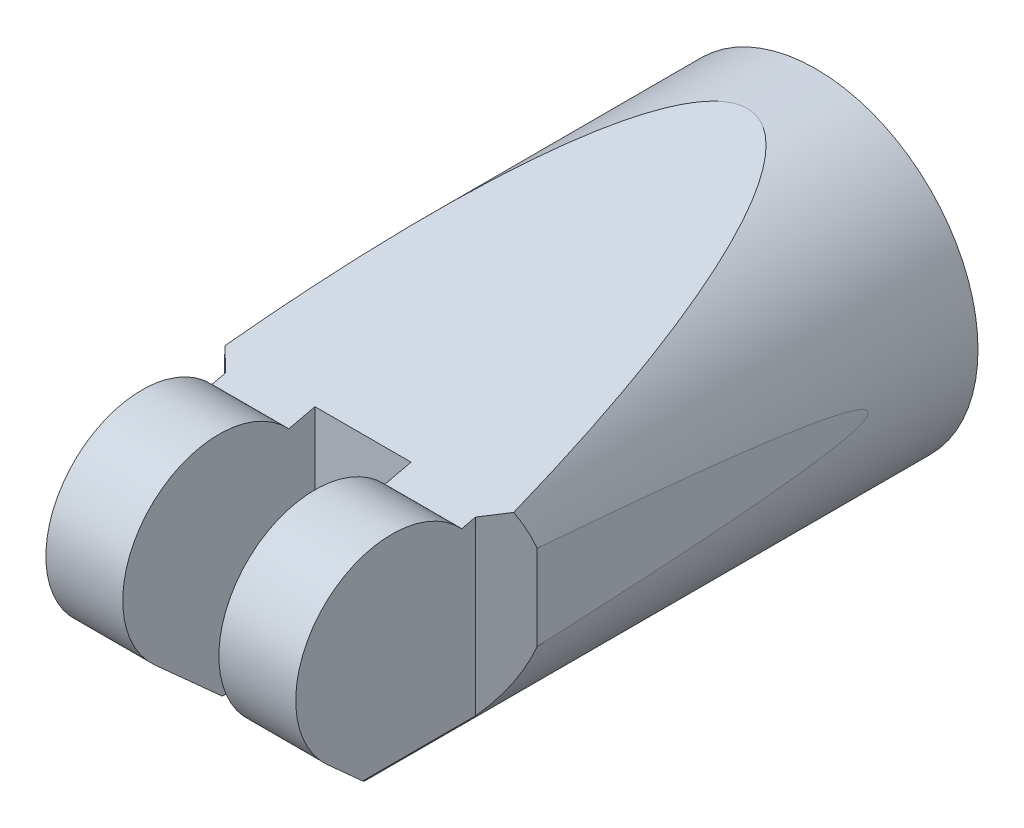
ISO-10303-21;
HEADER;
FILE_DESCRIPTION(('STEP AP214'),'2;1');
FILE_NAME('part.step','',(''),(''),'','','');
FILE_SCHEMA(('AUTOMOTIVE_DESIGN { 1 0 10303 214 1 1 1 1 }'));
ENDSEC;
DATA;
#1=APPLICATION_CONTEXT('core data for automotive mechanical design processes');
#2=APPLICATION_PROTOCOL_DEFINITION('international standard','automotive_design',2000,#1);
#3=PRODUCT_CONTEXT('',#1,'mechanical');
#4=PRODUCT('Part','Part','',(#3));
#5=PRODUCT_RELATED_PRODUCT_CATEGORY('part','',(#4));
#6=PRODUCT_DEFINITION_FORMATION('','',#4);
#7=PRODUCT_DEFINITION_CONTEXT('part definition',#1,'design');
#8=PRODUCT_DEFINITION('design','',#6,#7);
#9=PRODUCT_DEFINITION_SHAPE('','',#8);
#10=(LENGTH_UNIT() NAMED_UNIT(*) SI_UNIT(.MILLI.,.METRE.));
#11=(NAMED_UNIT(*) PLANE_ANGLE_UNIT() SI_UNIT($,.RADIAN.));
#12=(NAMED_UNIT(*) SI_UNIT($,.STERADIAN.) SOLID_ANGLE_UNIT());
#13=UNCERTAINTY_MEASURE_WITH_UNIT(LENGTH_MEASURE(1.E-05),#10,'distance_accuracy_value','');
#14=(GEOMETRIC_REPRESENTATION_CONTEXT(3) GLOBAL_UNCERTAINTY_ASSIGNED_CONTEXT((#13)) GLOBAL_UNIT_ASSIGNED_CONTEXT((#10,
#11,#12)) REPRESENTATION_CONTEXT('',''));
#15=CARTESIAN_POINT('',(0.,0.,0.));
#16=DIRECTION('',(0.,0.,1.));
#17=DIRECTION('',(1.,0.,0.));
#18=AXIS2_PLACEMENT_3D('',#15,#16,#17);
#19=CARTESIAN_POINT('',(49.,0.,976.));
#20=DIRECTION('',(0.,0.,-1.));
#21=DIRECTION('',(-1.,0.,0.));
#22=AXIS2_PLACEMENT_3D('',#19,#20,#21);
#23=CYLINDRICAL_SURFACE('',#22,59.);
#24=CARTESIAN_POINT('',(49.,0.,741.));
#25=DIRECTION('',(0.,0.,1.));
#26=DIRECTION('',(1.,0.,0.));
#27=AXIS2_PLACEMENT_3D('',#24,#25,#26);
#28=CIRCLE('',#27,59.);
#29=CARTESIAN_POINT('',(108.,0.,741.));
#30=VERTEX_POINT('',#29);
#31=EDGE_CURVE('E269',#30,#30,#28,.T.);
#32=ORIENTED_EDGE('',*,*,#31,.T.);
#33=EDGE_LOOP('',(#32));
#34=FACE_BOUND('',#33,.T.);
#35=CARTESIAN_POINT('',(49.,0.,993.306679245261));
#36=DIRECTION('',(0.,-0.743144825477394,0.669130606358859));
#37=DIRECTION('',(0.,-0.669130606358859,-0.743144825477394));
#38=AXIS2_PLACEMENT_3D('',#35,#36,#37);
#39=ELLIPSE('',#38,88.1741164420119,59.);
#40=CARTESIAN_POINT('',(83.0258725090187,-48.2,939.775156030494));
#41=VERTEX_POINT('',#40);
#42=CARTESIAN_POINT('',(94.5,-37.5599520766468,951.592126412552));
#43=VERTEX_POINT('',#42);
#44=EDGE_CURVE('E37',#41,#43,#39,.T.);
#45=ORIENTED_EDGE('',*,*,#44,.F.);
#46=CARTESIAN_POINT('',(49.,0.,1648.38279683326));
#47=DIRECTION('',(0.,-0.99769458797403,0.0678639015038982));
#48=DIRECTION('',(0.,-0.0678639015038982,-0.99769458797403));
#49=AXIS2_PLACEMENT_3D('',#46,#47,#48);
#50=ELLIPSE('',#49,869.387092291047,59.);
#51=CARTESIAN_POINT('',(14.9741274909811,-48.2,939.775156030494));
#52=VERTEX_POINT('',#51);
#53=EDGE_CURVE('E152',#52,#41,#50,.T.);
#54=ORIENTED_EDGE('',*,*,#53,.F.);
#55=CARTESIAN_POINT('',(3.5,-37.5599520766468,951.592126412552));
#56=VERTEX_POINT('',#55);
#57=EDGE_CURVE('E154',#56,#52,#39,.T.);
#58=ORIENTED_EDGE('',*,*,#57,.F.);
#59=DIRECTION('',(0.,0.,-1.));
#60=VECTOR('',#59,1.);
#61=CARTESIAN_POINT('',(3.5,-37.5599520766468,976.));
#62=LINE('',#61,#60);
#63=CARTESIAN_POINT('',(3.5,-37.5599520766468,910.53488902168));
#64=VERTEX_POINT('',#63);
#65=EDGE_CURVE('E263',#56,#64,#62,.T.);
#66=ORIENTED_EDGE('',*,*,#65,.T.);
#67=CARTESIAN_POINT('',(49.,0.,954.473728275402));
#68=DIRECTION('',(0.694658370458998,0.,-0.719339800338651));
#69=DIRECTION('',(-0.719339800338651,0.,-0.694658370458998));
#70=AXIS2_PLACEMENT_3D('',#67,#68,#69);
#71=ELLIPSE('',#70,82.0196518699841,59.);
#72=CARTESIAN_POINT('',(-7.93165389174711,-15.4850503760988,899.495469180941));
#73=VERTEX_POINT('',#72);
#74=EDGE_CURVE('E276',#64,#73,#71,.T.);
#75=ORIENTED_EDGE('',*,*,#74,.T.);
#76=CARTESIAN_POINT('',(49.,0.,4161.10773621489));
#77=DIRECTION('',(0.999847695156391,0.,-0.0174524064372831));
#78=DIRECTION('',(-0.0174524064372831,0.,-0.999847695156391));
#79=AXIS2_PLACEMENT_3D('',#76,#77,#78);
#80=ELLIPSE('',#79,3380.62262141454,59.);
#81=CARTESIAN_POINT('',(-7.93165389174711,15.4850503760988,899.495469180941));
#82=VERTEX_POINT('',#81);
#83=EDGE_CURVE('E273',#73,#82,#80,.T.);
#84=ORIENTED_EDGE('',*,*,#83,.T.);
#85=CARTESIAN_POINT('',(-3.58252698400946,26.759631088188,903.695372215954));
#86=VERTEX_POINT('',#85);
#87=EDGE_CURVE('E280',#82,#86,#71,.T.);
#88=ORIENTED_EDGE('',*,*,#87,.T.);
#89=CARTESIAN_POINT('',(49.,0.,1017.98306455373));
#90=DIRECTION('',(0.,0.973666533946042,0.227976930134392));
#91=DIRECTION('',(0.,0.227976930134392,-0.973666533946042));
#92=AXIS2_PLACEMENT_3D('',#89,#90,#91);
#93=ELLIPSE('',#92,258.798115955064,59.);
#94=CARTESIAN_POINT('',(101.582526984009,26.7596310881882,903.695372215954));
#95=VERTEX_POINT('',#94);
#96=EDGE_CURVE('E220',#95,#86,#93,.T.);
#97=ORIENTED_EDGE('',*,*,#96,.F.);
#98=CARTESIAN_POINT('',(49.,0.,954.473728275402));
#99=DIRECTION('',(0.694658370458997,0.,0.719339800338652));
#100=DIRECTION('',(0.719339800338652,0.,-0.694658370458997));
#101=AXIS2_PLACEMENT_3D('',#98,#99,#100);
#102=ELLIPSE('',#101,82.019651869984,59.);
#103=CARTESIAN_POINT('',(105.931653891747,15.4850503760988,899.495469180941));
#104=VERTEX_POINT('',#103);
#105=EDGE_CURVE('E281',#104,#95,#102,.T.);
#106=ORIENTED_EDGE('',*,*,#105,.F.);
#107=CARTESIAN_POINT('',(49.,0.,4161.1077362149));
#108=DIRECTION('',(0.999847695156391,0.,0.0174524064372831));
#109=DIRECTION('',(0.0174524064372831,0.,-0.999847695156391));
#110=AXIS2_PLACEMENT_3D('',#107,#108,#109);
#111=ELLIPSE('',#110,3380.62262141455,59.);
#112=CARTESIAN_POINT('',(105.931653891747,-15.4850503760984,899.495469180941));
#113=VERTEX_POINT('',#112);
#114=EDGE_CURVE('E49',#113,#104,#111,.T.);
#115=ORIENTED_EDGE('',*,*,#114,.F.);
#116=CARTESIAN_POINT('',(94.5,-37.5599520766468,910.53488902168));
#117=VERTEX_POINT('',#116);
#118=EDGE_CURVE('E285',#117,#113,#102,.T.);
#119=ORIENTED_EDGE('',*,*,#118,.F.);
#120=DIRECTION('',(0.,0.,-1.));
#121=VECTOR('',#120,1.);
#122=CARTESIAN_POINT('',(94.5,-37.5599520766468,976.));
#123=LINE('',#122,#121);
#124=EDGE_CURVE('E266',#43,#117,#123,.T.);
#125=ORIENTED_EDGE('',*,*,#124,.F.);
#126=EDGE_LOOP('',(#45,#54,#58,#66,#75,#84,#88,#97,#106,#115,#119,#125));
#127=FACE_BOUND('',#126,.T.);
#128=ADVANCED_FACE('F17',(#34,#127),#23,.T.);
#129=CARTESIAN_POINT('',(49.,1056.01589394116,906.));
#130=DIRECTION('',(0.,0.,-1.));
#131=DIRECTION('',(-1.,0.,0.));
#132=AXIS2_PLACEMENT_3D('',#129,#130,#131);
#133=PLANE('',#132);
#134=DIRECTION('',(-1.,0.,0.));
#135=VECTOR('',#134,1.);
#136=CARTESIAN_POINT('',(49.,-50.4974103395577,906.));
#137=LINE('',#136,#135);
#138=CARTESIAN_POINT('',(66.5,-50.4974103395579,906.));
#139=VERTEX_POINT('',#138);
#140=CARTESIAN_POINT('',(31.5,-50.4974103395577,906.));
#141=VERTEX_POINT('',#140);
#142=EDGE_CURVE('E197',#139,#141,#137,.T.);
#143=ORIENTED_EDGE('',*,*,#142,.F.);
#144=DIRECTION('',(0.,-1.,0.));
#145=VECTOR('',#144,1.);
#146=CARTESIAN_POINT('',(66.5,1056.01589394116,906.));
#147=LINE('',#146,#145);
#148=CARTESIAN_POINT('',(66.5,26.2200192714197,906.));
#149=VERTEX_POINT('',#148);
#150=EDGE_CURVE('E249',#149,#139,#147,.T.);
#151=ORIENTED_EDGE('',*,*,#150,.F.);
#152=DIRECTION('',(1.,0.,0.));
#153=VECTOR('',#152,1.);
#154=CARTESIAN_POINT('',(49.,26.2200192714197,906.));
#155=LINE('',#154,#153);
#156=CARTESIAN_POINT('',(31.5,26.2200192714197,906.));
#157=VERTEX_POINT('',#156);
#158=EDGE_CURVE('E233',#157,#149,#155,.T.);
#159=ORIENTED_EDGE('',*,*,#158,.F.);
#160=DIRECTION('',(0.,-1.,0.));
#161=VECTOR('',#160,1.);
#162=CARTESIAN_POINT('',(31.5,1056.01589394116,906.));
#163=LINE('',#162,#161);
#164=EDGE_CURVE('E259',#157,#141,#163,.T.);
#165=ORIENTED_EDGE('',*,*,#164,.T.);
#166=EDGE_LOOP('',(#143,#151,#159,#165));
#167=FACE_BOUND('',#166,.T.);
#168=ADVANCED_FACE('F370',(#167),#133,.F.);
#169=CARTESIAN_POINT('',(31.5,1056.01589394116,941.));
#170=DIRECTION('',(-1.,0.,0.));
#171=DIRECTION('',(0.,0.,1.));
#172=AXIS2_PLACEMENT_3D('',#169,#170,#171);
#173=PLANE('',#172);
#174=CARTESIAN_POINT('',(31.5,-1.01114327064304E-13,941.));
#175=DIRECTION('',(-1.,0.,0.));
#176=DIRECTION('',(0.,0.,1.));
#177=AXIS2_PLACEMENT_3D('',#174,#175,#176);
#178=CIRCLE('',#177,35.);
#179=CARTESIAN_POINT('',(31.5,-26.0100688917089,964.41957122256));
#180=VERTEX_POINT('',#179);
#181=CARTESIAN_POINT('',(31.5,23.9917427014978,915.516745063765));
#182=VERTEX_POINT('',#181);
#183=EDGE_CURVE('E213',#180,#182,#178,.T.);
#184=ORIENTED_EDGE('',*,*,#183,.F.);
#185=DIRECTION('',(0.,0.669130606358859,0.743144825477394));
#186=VECTOR('',#185,1.);
#187=CARTESIAN_POINT('',(31.5,446.80601878893,1489.53503541325));
#188=LINE('',#187,#186);
#189=CARTESIAN_POINT('',(31.5,-48.2,939.775156030494));
#190=VERTEX_POINT('',#189);
#191=EDGE_CURVE('E194',#190,#180,#188,.T.);
#192=ORIENTED_EDGE('',*,*,#191,.F.);
#193=DIRECTION('',(0.,0.0678639015038982,0.99769458797403));
#194=VECTOR('',#193,1.);
#195=CARTESIAN_POINT('',(31.5,-43.0315925634566,1015.75799836071));
#196=LINE('',#195,#194);
#197=EDGE_CURVE('E162',#141,#190,#196,.T.);
#198=ORIENTED_EDGE('',*,*,#197,.F.);
#199=ORIENTED_EDGE('',*,*,#164,.F.);
#200=DIRECTION('',(0.,0.227976930134392,-0.973666533946042));
#201=VECTOR('',#200,1.);
#202=CARTESIAN_POINT('',(31.5,71.973022502793,710.593525986809));
#203=LINE('',#202,#201);
#204=EDGE_CURVE('E236',#182,#157,#203,.T.);
#205=ORIENTED_EDGE('',*,*,#204,.F.);
#206=EDGE_LOOP('',(#184,#192,#198,#199,#205));
#207=FACE_BOUND('',#206,.T.);
#208=ADVANCED_FACE('F375',(#207),#173,.F.);
#209=CARTESIAN_POINT('',(66.5,1056.01589394116,941.));
#210=DIRECTION('',(-1.,0.,0.));
#211=DIRECTION('',(0.,0.,1.));
#212=AXIS2_PLACEMENT_3D('',#209,#210,#211);
#213=PLANE('',#212);
#214=DIRECTION('',(0.,0.669130606358859,0.743144825477394));
#215=VECTOR('',#214,1.);
#216=CARTESIAN_POINT('',(66.5,446.80601878893,1489.53503541325));
#217=LINE('',#216,#215);
#218=CARTESIAN_POINT('',(66.5,-48.2,939.775156030494));
#219=VERTEX_POINT('',#218);
#220=CARTESIAN_POINT('',(66.5,-26.0100688917089,964.41957122256));
#221=VERTEX_POINT('',#220);
#222=EDGE_CURVE('E174',#219,#221,#217,.T.);
#223=ORIENTED_EDGE('',*,*,#222,.T.);
#224=CARTESIAN_POINT('',(66.5,-1.01114327064304E-13,941.));
#225=DIRECTION('',(-1.,0.,0.));
#226=DIRECTION('',(0.,0.,1.));
#227=AXIS2_PLACEMENT_3D('',#224,#225,#226);
#228=CIRCLE('',#227,35.);
#229=CARTESIAN_POINT('',(66.5,23.9917427014978,915.516745063765));
#230=VERTEX_POINT('',#229);
#231=EDGE_CURVE('E209',#221,#230,#228,.T.);
#232=ORIENTED_EDGE('',*,*,#231,.T.);
#233=DIRECTION('',(0.,0.227976930134392,-0.973666533946042));
#234=VECTOR('',#233,1.);
#235=CARTESIAN_POINT('',(66.5,71.973022502793,710.593525986809));
#236=LINE('',#235,#234);
#237=EDGE_CURVE('E229',#230,#149,#236,.T.);
#238=ORIENTED_EDGE('',*,*,#237,.T.);
#239=ORIENTED_EDGE('',*,*,#150,.T.);
#240=DIRECTION('',(0.,0.0678639015038982,0.99769458797403));
#241=VECTOR('',#240,1.);
#242=CARTESIAN_POINT('',(66.5,-43.0315925634566,1015.75799836071));
#243=LINE('',#242,#241);
#244=EDGE_CURVE('E11',#139,#219,#243,.T.);
#245=ORIENTED_EDGE('',*,*,#244,.T.);
#246=EDGE_LOOP('',(#223,#232,#238,#239,#245));
#247=FACE_BOUND('',#246,.T.);
#248=ADVANCED_FACE('F363',(#247),#213,.T.);
#249=CARTESIAN_POINT('',(3.5,1056.01589394116,943.26744451084));
#250=DIRECTION('',(1.,0.,0.));
#251=DIRECTION('',(0.,0.,-1.));
#252=AXIS2_PLACEMENT_3D('',#249,#250,#251);
#253=PLANE('',#252);
#254=DIRECTION('',(0.,-0.669130606358859,-0.743144825477394));
#255=VECTOR('',#254,1.);
#256=CARTESIAN_POINT('',(3.5,447.933530395212,1490.78726391381));
#257=LINE('',#256,#255);
#258=CARTESIAN_POINT('',(3.50000000000006,-26.0100688917089,964.41957122256));
#259=VERTEX_POINT('',#258);
#260=EDGE_CURVE('E172',#259,#56,#257,.T.);
#261=ORIENTED_EDGE('',*,*,#260,.F.);
#262=CARTESIAN_POINT('',(3.50000000000006,-1.01114327064304E-13,941.));
#263=DIRECTION('',(1.,0.,0.));
#264=DIRECTION('',(0.,0.,-1.));
#265=AXIS2_PLACEMENT_3D('',#262,#263,#264);
#266=CIRCLE('',#265,35.);
#267=CARTESIAN_POINT('',(3.50000000000006,23.9917427014978,915.516745063765));
#268=VERTEX_POINT('',#267);
#269=EDGE_CURVE('E206',#268,#259,#266,.T.);
#270=ORIENTED_EDGE('',*,*,#269,.F.);
#271=DIRECTION('',(0.,-0.227976930134392,0.973666533946042));
#272=VECTOR('',#271,1.);
#273=CARTESIAN_POINT('',(3.5,71.469709891924,712.743123514186));
#274=LINE('',#273,#272);
#275=CARTESIAN_POINT('',(3.5,25.1582080232986,910.53488902168));
#276=VERTEX_POINT('',#275);
#277=EDGE_CURVE('E226',#276,#268,#274,.T.);
#278=ORIENTED_EDGE('',*,*,#277,.F.);
#279=DIRECTION('',(0.,-1.,0.));
#280=VECTOR('',#279,1.);
#281=CARTESIAN_POINT('',(3.5,1056.01589394116,910.53488902168));
#282=LINE('',#281,#280);
#283=EDGE_CURVE('E240',#276,#64,#282,.T.);
#284=ORIENTED_EDGE('',*,*,#283,.T.);
#285=ORIENTED_EDGE('',*,*,#65,.F.);
#286=EDGE_LOOP('',(#261,#270,#278,#284,#285));
#287=FACE_BOUND('',#286,.T.);
#288=ADVANCED_FACE('F358',(#287),#253,.F.);
#289=CARTESIAN_POINT('',(94.5,1056.01589394116,943.26744451084));
#290=DIRECTION('',(1.,0.,0.));
#291=DIRECTION('',(0.,0.,-1.));
#292=AXIS2_PLACEMENT_3D('',#289,#290,#291);
#293=PLANE('',#292);
#294=CARTESIAN_POINT('',(94.5,-1.01114327064304E-13,941.));
#295=DIRECTION('',(1.,0.,0.));
#296=DIRECTION('',(0.,0.,-1.));
#297=AXIS2_PLACEMENT_3D('',#294,#295,#296);
#298=CIRCLE('',#297,35.);
#299=CARTESIAN_POINT('',(94.5,23.9917427014978,915.516745063765));
#300=VERTEX_POINT('',#299);
#301=CARTESIAN_POINT('',(94.5,-26.0100688917089,964.41957122256));
#302=VERTEX_POINT('',#301);
#303=EDGE_CURVE('E288',#300,#302,#298,.T.);
#304=ORIENTED_EDGE('',*,*,#303,.T.);
#305=DIRECTION('',(0.,-0.669130606358859,-0.743144825477394));
#306=VECTOR('',#305,1.);
#307=CARTESIAN_POINT('',(94.5,447.933530395212,1490.78726391381));
#308=LINE('',#307,#306);
#309=EDGE_CURVE('E25',#302,#43,#308,.T.);
#310=ORIENTED_EDGE('',*,*,#309,.T.);
#311=ORIENTED_EDGE('',*,*,#124,.T.);
#312=DIRECTION('',(0.,-1.,0.));
#313=VECTOR('',#312,1.);
#314=CARTESIAN_POINT('',(94.5,1056.01589394116,910.53488902168));
#315=LINE('',#314,#313);
#316=CARTESIAN_POINT('',(94.5,25.1582080232987,910.53488902168));
#317=VERTEX_POINT('',#316);
#318=EDGE_CURVE('E239',#317,#117,#315,.T.);
#319=ORIENTED_EDGE('',*,*,#318,.F.);
#320=DIRECTION('',(0.,-0.227976930134392,0.973666533946042));
#321=VECTOR('',#320,1.);
#322=CARTESIAN_POINT('',(94.5,71.469709891924,712.743123514186));
#323=LINE('',#322,#321);
#324=EDGE_CURVE('E291',#317,#300,#323,.T.);
#325=ORIENTED_EDGE('',*,*,#324,.T.);
#326=EDGE_LOOP('',(#304,#310,#311,#319,#325));
#327=FACE_BOUND('',#326,.T.);
#328=ADVANCED_FACE('F297',(#327),#293,.T.);
#329=CARTESIAN_POINT('',(-2.21582694587358,1056.01589394116,905.01517910131));
#330=DIRECTION('',(0.694658370458998,0.,-0.719339800338651));
#331=DIRECTION('',(-0.719339800338651,0.,-0.694658370458998));
#332=AXIS2_PLACEMENT_3D('',#329,#330,#331);
#333=PLANE('',#332);
#334=DIRECTION('',(0.710009538236028,-0.160539543780024,0.685648241080486));
#335=VECTOR('',#334,1.);
#336=CARTESIAN_POINT('',(-119.570421812588,52.985537526075,791.687164166492));
#337=LINE('',#336,#335);
#338=EDGE_CURVE('E223',#86,#276,#337,.T.);
#339=ORIENTED_EDGE('',*,*,#338,.F.);
#340=ORIENTED_EDGE('',*,*,#87,.F.);
#341=DIRECTION('',(0.,-1.,0.));
#342=VECTOR('',#341,1.);
#343=CARTESIAN_POINT('',(-7.93165389174711,1056.01589394116,899.495469180941));
#344=LINE('',#343,#342);
#345=EDGE_CURVE('E244',#82,#73,#344,.T.);
#346=ORIENTED_EDGE('',*,*,#345,.T.);
#347=ORIENTED_EDGE('',*,*,#74,.F.);
#348=ORIENTED_EDGE('',*,*,#283,.F.);
#349=EDGE_LOOP('',(#339,#340,#346,#347,#348));
#350=FACE_BOUND('',#349,.T.);
#351=ADVANCED_FACE('F345',(#350),#333,.F.);
#352=CARTESIAN_POINT('',(100.215826945874,1056.01589394116,905.01517910131));
#353=DIRECTION('',(0.694658370458997,0.,0.719339800338652));
#354=DIRECTION('',(0.719339800338652,0.,-0.694658370458997));
#355=AXIS2_PLACEMENT_3D('',#352,#353,#354);
#356=PLANE('',#355);
#357=ORIENTED_EDGE('',*,*,#105,.T.);
#358=DIRECTION('',(-0.710009538236028,-0.160539543780024,0.685648241080485));
#359=VECTOR('',#358,1.);
#360=CARTESIAN_POINT('',(217.570421812589,52.9855375260753,791.687164166492));
#361=LINE('',#360,#359);
#362=EDGE_CURVE('E216',#95,#317,#361,.T.);
#363=ORIENTED_EDGE('',*,*,#362,.T.);
#364=ORIENTED_EDGE('',*,*,#318,.T.);
#365=ORIENTED_EDGE('',*,*,#118,.T.);
#366=DIRECTION('',(0.,-1.,0.));
#367=VECTOR('',#366,1.);
#368=CARTESIAN_POINT('',(105.931653891747,1056.01589394116,899.495469180941));
#369=LINE('',#368,#367);
#370=EDGE_CURVE('E245',#104,#113,#369,.T.);
#371=ORIENTED_EDGE('',*,*,#370,.F.);
#372=EDGE_LOOP('',(#357,#363,#364,#365,#371));
#373=FACE_BOUND('',#372,.T.);
#374=ADVANCED_FACE('F350',(#373),#356,.T.);
#375=CARTESIAN_POINT('',(49.,0.,741.));
#376=DIRECTION('',(0.,0.,1.));
#377=DIRECTION('',(1.,0.,0.));
#378=AXIS2_PLACEMENT_3D('',#375,#376,#377);
#379=PLANE('',#378);
#380=ORIENTED_EDGE('',*,*,#31,.F.);
#381=EDGE_LOOP('',(#380));
#382=FACE_BOUND('',#381,.T.);
#383=ADVANCED_FACE('F402',(#382),#379,.F.);
#384=CARTESIAN_POINT('',(-8.96582694587355,1056.01589394116,840.24773459047));
#385=DIRECTION('',(0.999847695156391,0.,-0.0174524064372831));
#386=DIRECTION('',(-0.0174524064372831,0.,-0.999847695156391));
#387=AXIS2_PLACEMENT_3D('',#384,#385,#386);
#388=PLANE('',#387);
#389=ORIENTED_EDGE('',*,*,#83,.F.);
#390=ORIENTED_EDGE('',*,*,#345,.F.);
#391=EDGE_LOOP('',(#389,#390));
#392=FACE_BOUND('',#391,.T.);
#393=ADVANCED_FACE('F456',(#392),#388,.F.);
#394=CARTESIAN_POINT('',(106.965826945874,1056.01589394116,840.24773459047));
#395=DIRECTION('',(0.999847695156391,0.,0.0174524064372831));
#396=DIRECTION('',(0.0174524064372831,0.,-0.999847695156391));
#397=AXIS2_PLACEMENT_3D('',#394,#395,#396);
#398=PLANE('',#397);
#399=ORIENTED_EDGE('',*,*,#114,.T.);
#400=ORIENTED_EDGE('',*,*,#370,.T.);
#401=EDGE_LOOP('',(#399,#400));
#402=FACE_BOUND('',#401,.T.);
#403=ADVANCED_FACE('F325',(#402),#398,.T.);
#404=CARTESIAN_POINT('',(-1056.01589394116,41.4958713507489,840.758372531883));
#405=DIRECTION('',(0.,0.973666533946042,0.227976930134392));
#406=DIRECTION('',(0.,-0.227976930134392,0.973666533946042));
#407=AXIS2_PLACEMENT_3D('',#404,#405,#406);
#408=PLANE('',#407);
#409=ORIENTED_EDGE('',*,*,#204,.T.);
#410=ORIENTED_EDGE('',*,*,#158,.T.);
#411=ORIENTED_EDGE('',*,*,#237,.F.);
#412=DIRECTION('',(1.,0.,0.));
#413=VECTOR('',#412,1.);
#414=CARTESIAN_POINT('',(-1056.01589394116,23.9917427014978,915.516745063765));
#415=LINE('',#414,#413);
#416=EDGE_CURVE('E161',#230,#300,#415,.T.);
#417=ORIENTED_EDGE('',*,*,#416,.T.);
#418=ORIENTED_EDGE('',*,*,#324,.F.);
#419=ORIENTED_EDGE('',*,*,#362,.F.);
#420=ORIENTED_EDGE('',*,*,#96,.T.);
#421=ORIENTED_EDGE('',*,*,#338,.T.);
#422=ORIENTED_EDGE('',*,*,#277,.T.);
#423=EDGE_CURVE('E205',#268,#182,#415,.T.);
#424=ORIENTED_EDGE('',*,*,#423,.T.);
#425=EDGE_LOOP('',(#409,#410,#411,#417,#418,#419,#420,#421,#422,#424));
#426=FACE_BOUND('',#425,.T.);
#427=ADVANCED_FACE('F319',(#426),#408,.T.);
#428=CARTESIAN_POINT('',(-1056.01589394116,-1.01114327064304E-13,941.));
#429=DIRECTION('',(1.,0.,0.));
#430=DIRECTION('',(0.,0.,-1.));
#431=AXIS2_PLACEMENT_3D('',#428,#429,#430);
#432=CYLINDRICAL_SURFACE('',#431,35.);
#433=ORIENTED_EDGE('',*,*,#183,.T.);
#434=ORIENTED_EDGE('',*,*,#423,.F.);
#435=ORIENTED_EDGE('',*,*,#269,.T.);
#436=DIRECTION('',(1.,0.,0.));
#437=VECTOR('',#436,1.);
#438=CARTESIAN_POINT('',(-1056.01589394116,-26.0100688917089,964.41957122256));
#439=LINE('',#438,#437);
#440=EDGE_CURVE('E185',#259,#180,#439,.T.);
#441=ORIENTED_EDGE('',*,*,#440,.T.);
#442=EDGE_LOOP('',(#433,#434,#435,#441));
#443=FACE_BOUND('',#442,.T.);
#444=ADVANCED_FACE('F324',(#443),#432,.T.);
#445=ORIENTED_EDGE('',*,*,#231,.F.);
#446=EDGE_CURVE('E187',#221,#302,#439,.T.);
#447=ORIENTED_EDGE('',*,*,#446,.T.);
#448=ORIENTED_EDGE('',*,*,#303,.F.);
#449=ORIENTED_EDGE('',*,*,#416,.F.);
#450=EDGE_LOOP('',(#445,#447,#448,#449));
#451=FACE_BOUND('',#450,.T.);
#452=ADVANCED_FACE('F338',(#451),#432,.T.);
#453=CARTESIAN_POINT('',(-1056.01589394116,-53.6,860.387578015247));
#454=DIRECTION('',(0.,-0.99769458797403,0.0678639015038982));
#455=DIRECTION('',(0.,-0.0678639015038982,-0.99769458797403));
#456=AXIS2_PLACEMENT_3D('',#453,#454,#455);
#457=PLANE('',#456);
#458=ORIENTED_EDGE('',*,*,#53,.T.);
#459=DIRECTION('',(1.,0.,0.));
#460=VECTOR('',#459,1.);
#461=CARTESIAN_POINT('',(-1056.01589394116,-48.2,939.775156030494));
#462=LINE('',#461,#460);
#463=EDGE_CURVE('E179',#219,#41,#462,.T.);
#464=ORIENTED_EDGE('',*,*,#463,.F.);
#465=ORIENTED_EDGE('',*,*,#244,.F.);
#466=ORIENTED_EDGE('',*,*,#142,.T.);
#467=ORIENTED_EDGE('',*,*,#197,.T.);
#468=EDGE_CURVE('E168',#52,#190,#462,.T.);
#469=ORIENTED_EDGE('',*,*,#468,.F.);
#470=EDGE_LOOP('',(#458,#464,#465,#466,#467,#469));
#471=FACE_BOUND('',#470,.T.);
#472=ADVANCED_FACE('F176',(#471),#457,.T.);
#473=CARTESIAN_POINT('',(-1056.01589394116,-37.1050344458545,952.097363626527));
#474=DIRECTION('',(0.,-0.743144825477394,0.669130606358859));
#475=DIRECTION('',(0.,-0.669130606358859,-0.743144825477394));
#476=AXIS2_PLACEMENT_3D('',#473,#474,#475);
#477=PLANE('',#476);
#478=ORIENTED_EDGE('',*,*,#191,.T.);
#479=ORIENTED_EDGE('',*,*,#440,.F.);
#480=ORIENTED_EDGE('',*,*,#260,.T.);
#481=ORIENTED_EDGE('',*,*,#57,.T.);
#482=ORIENTED_EDGE('',*,*,#468,.T.);
#483=EDGE_LOOP('',(#478,#479,#480,#481,#482));
#484=FACE_BOUND('',#483,.T.);
#485=ADVANCED_FACE('F167',(#484),#477,.T.);
#486=ORIENTED_EDGE('',*,*,#463,.T.);
#487=ORIENTED_EDGE('',*,*,#44,.T.);
#488=ORIENTED_EDGE('',*,*,#309,.F.);
#489=ORIENTED_EDGE('',*,*,#446,.F.);
#490=ORIENTED_EDGE('',*,*,#222,.F.);
#491=EDGE_LOOP('',(#486,#487,#488,#489,#490));
#492=FACE_BOUND('',#491,.T.);
#493=ADVANCED_FACE('F505',(#492),#477,.T.);
#494=CLOSED_SHELL('',(#128,#168,#208,#248,#288,#328,#351,#374,#383,#393,#403,#427,#444,#452,
#472,#485,#493));
#495=MANIFOLD_SOLID_BREP('B1',#494);
#496=ADVANCED_BREP_SHAPE_REPRESENTATION('',(#18,#495),#14);
#497=SHAPE_DEFINITION_REPRESENTATION(#9,#496);
ENDSEC;
END-ISO-10303-21;
